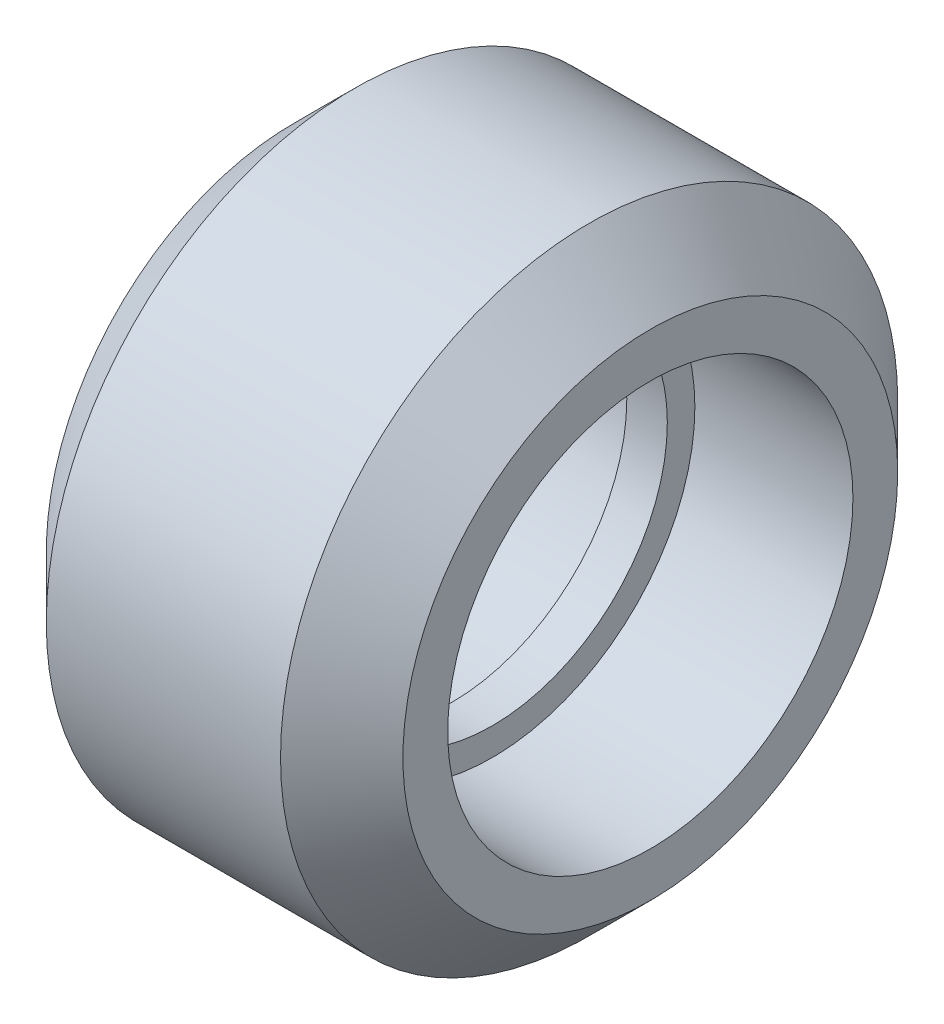
ISO-10303-21;
HEADER;
FILE_DESCRIPTION(('STEP AP214'),'2;1');
FILE_NAME('part.step','',(''),(''),'','','');
FILE_SCHEMA(('AUTOMOTIVE_DESIGN { 1 0 10303 214 1 1 1 1 }'));
ENDSEC;
DATA;
#1=APPLICATION_CONTEXT('core data for automotive mechanical design processes');
#2=APPLICATION_PROTOCOL_DEFINITION('international standard','automotive_design',2000,#1);
#3=PRODUCT_CONTEXT('',#1,'mechanical');
#4=PRODUCT('Part','Part','',(#3));
#5=PRODUCT_RELATED_PRODUCT_CATEGORY('part','',(#4));
#6=PRODUCT_DEFINITION_FORMATION('','',#4);
#7=PRODUCT_DEFINITION_CONTEXT('part definition',#1,'design');
#8=PRODUCT_DEFINITION('design','',#6,#7);
#9=PRODUCT_DEFINITION_SHAPE('','',#8);
#10=(LENGTH_UNIT() NAMED_UNIT(*) SI_UNIT(.MILLI.,.METRE.));
#11=(NAMED_UNIT(*) PLANE_ANGLE_UNIT() SI_UNIT($,.RADIAN.));
#12=(NAMED_UNIT(*) SI_UNIT($,.STERADIAN.) SOLID_ANGLE_UNIT());
#13=UNCERTAINTY_MEASURE_WITH_UNIT(LENGTH_MEASURE(1.E-05),#10,'distance_accuracy_value','');
#14=(GEOMETRIC_REPRESENTATION_CONTEXT(3) GLOBAL_UNCERTAINTY_ASSIGNED_CONTEXT((#13)) GLOBAL_UNIT_ASSIGNED_CONTEXT((#10,
#11,#12)) REPRESENTATION_CONTEXT('',''));
#15=CARTESIAN_POINT('',(0.,0.,0.));
#16=DIRECTION('',(0.,0.,1.));
#17=DIRECTION('',(1.,0.,0.));
#18=AXIS2_PLACEMENT_3D('',#15,#16,#17);
#19=CARTESIAN_POINT('',(-0.5,4.32,0.));
#20=DIRECTION('',(-1.,0.,0.));
#21=DIRECTION('',(0.,0.,1.));
#22=AXIS2_PLACEMENT_3D('',#19,#20,#21);
#23=PLANE('',#22);
#24=CARTESIAN_POINT('',(-0.5,0.,0.));
#25=DIRECTION('',(1.,0.,0.));
#26=DIRECTION('',(0.,0.,-1.));
#27=AXIS2_PLACEMENT_3D('',#24,#25,#26);
#28=CIRCLE('',#27,4.32);
#29=CARTESIAN_POINT('',(-0.5,0.,-4.32));
#30=VERTEX_POINT('',#29);
#31=EDGE_CURVE('E12',#30,#30,#28,.T.);
#32=ORIENTED_EDGE('',*,*,#31,.T.);
#33=EDGE_LOOP('',(#32));
#34=FACE_BOUND('',#33,.T.);
#35=CARTESIAN_POINT('',(-0.5,0.,0.));
#36=DIRECTION('',(1.,0.,0.));
#37=DIRECTION('',(0.,0.,-1.));
#38=AXIS2_PLACEMENT_3D('',#35,#36,#37);
#39=CIRCLE('',#38,5.);
#40=CARTESIAN_POINT('',(-0.5,0.,-5.));
#41=VERTEX_POINT('',#40);
#42=EDGE_CURVE('E76',#41,#41,#39,.T.);
#43=ORIENTED_EDGE('',*,*,#42,.F.);
#44=EDGE_LOOP('',(#43));
#45=FACE_BOUND('',#44,.T.);
#46=ADVANCED_FACE('F42',(#34,#45),#23,.T.);
#47=CARTESIAN_POINT('',(0.,0.,0.));
#48=DIRECTION('',(1.,0.,0.));
#49=DIRECTION('',(0.,0.,-1.));
#50=AXIS2_PLACEMENT_3D('',#47,#48,#49);
#51=CYLINDRICAL_SURFACE('',#50,4.32);
#52=CARTESIAN_POINT('',(0.5,0.,0.));
#53=DIRECTION('',(1.,0.,0.));
#54=DIRECTION('',(0.,0.,-1.));
#55=AXIS2_PLACEMENT_3D('',#52,#53,#54);
#56=CIRCLE('',#55,4.32);
#57=CARTESIAN_POINT('',(0.5,0.,-4.32));
#58=VERTEX_POINT('',#57);
#59=EDGE_CURVE('E48',#58,#58,#56,.T.);
#60=ORIENTED_EDGE('',*,*,#59,.T.);
#61=EDGE_LOOP('',(#60));
#62=FACE_BOUND('',#61,.T.);
#63=ORIENTED_EDGE('',*,*,#31,.F.);
#64=EDGE_LOOP('',(#63));
#65=FACE_BOUND('',#64,.T.);
#66=ADVANCED_FACE('F84',(#62,#65),#51,.F.);
#67=CARTESIAN_POINT('',(0.5,4.32,0.));
#68=DIRECTION('',(1.,0.,0.));
#69=DIRECTION('',(0.,0.,-1.));
#70=AXIS2_PLACEMENT_3D('',#67,#68,#69);
#71=PLANE('',#70);
#72=CARTESIAN_POINT('',(0.5,0.,0.));
#73=DIRECTION('',(1.,0.,0.));
#74=DIRECTION('',(0.,0.,-1.));
#75=AXIS2_PLACEMENT_3D('',#72,#73,#74);
#76=CIRCLE('',#75,5.);
#77=CARTESIAN_POINT('',(0.5,0.,-5.));
#78=VERTEX_POINT('',#77);
#79=EDGE_CURVE('E52',#78,#78,#76,.T.);
#80=ORIENTED_EDGE('',*,*,#79,.T.);
#81=EDGE_LOOP('',(#80));
#82=FACE_BOUND('',#81,.T.);
#83=ORIENTED_EDGE('',*,*,#59,.F.);
#84=EDGE_LOOP('',(#83));
#85=FACE_BOUND('',#84,.T.);
#86=ADVANCED_FACE('F88',(#82,#85),#71,.T.);
#87=CARTESIAN_POINT('',(0.,0.,0.));
#88=DIRECTION('',(1.,0.,0.));
#89=DIRECTION('',(0.,0.,-1.));
#90=AXIS2_PLACEMENT_3D('',#87,#88,#89);
#91=CYLINDRICAL_SURFACE('',#90,5.);
#92=CARTESIAN_POINT('',(4.4,0.,0.));
#93=DIRECTION('',(1.,0.,0.));
#94=DIRECTION('',(0.,0.,-1.));
#95=AXIS2_PLACEMENT_3D('',#92,#93,#94);
#96=CIRCLE('',#95,5.);
#97=CARTESIAN_POINT('',(4.4,0.,-5.));
#98=VERTEX_POINT('',#97);
#99=EDGE_CURVE('E56',#98,#98,#96,.T.);
#100=ORIENTED_EDGE('',*,*,#99,.T.);
#101=EDGE_LOOP('',(#100));
#102=FACE_BOUND('',#101,.T.);
#103=ORIENTED_EDGE('',*,*,#79,.F.);
#104=EDGE_LOOP('',(#103));
#105=FACE_BOUND('',#104,.T.);
#106=ADVANCED_FACE('F92',(#102,#105),#91,.F.);
#107=CARTESIAN_POINT('',(4.4,5.,0.));
#108=DIRECTION('',(1.,0.,0.));
#109=DIRECTION('',(0.,0.,-1.));
#110=AXIS2_PLACEMENT_3D('',#107,#108,#109);
#111=PLANE('',#110);
#112=CARTESIAN_POINT('',(4.4,0.,0.));
#113=DIRECTION('',(1.,0.,0.));
#114=DIRECTION('',(0.,0.,-1.));
#115=AXIS2_PLACEMENT_3D('',#112,#113,#114);
#116=CIRCLE('',#115,6.10500000000001);
#117=CARTESIAN_POINT('',(4.4,0.,-6.10500000000001));
#118=VERTEX_POINT('',#117);
#119=EDGE_CURVE('E61',#118,#118,#116,.T.);
#120=ORIENTED_EDGE('',*,*,#119,.T.);
#121=EDGE_LOOP('',(#120));
#122=FACE_BOUND('',#121,.T.);
#123=ORIENTED_EDGE('',*,*,#99,.F.);
#124=EDGE_LOOP('',(#123));
#125=FACE_BOUND('',#124,.T.);
#126=ADVANCED_FACE('F99',(#122,#125),#111,.T.);
#127=CARTESIAN_POINT('',(4.4,0.,0.));
#128=DIRECTION('',(-1.,0.,0.));
#129=DIRECTION('',(0.,0.,1.));
#130=AXIS2_PLACEMENT_3D('',#127,#128,#129);
#131=CONICAL_SURFACE('',#130,6.10500000000001,0.785398163397447);
#132=CARTESIAN_POINT('',(2.89,0.,0.));
#133=DIRECTION('',(1.,0.,0.));
#134=DIRECTION('',(0.,0.,-1.));
#135=AXIS2_PLACEMENT_3D('',#132,#133,#134);
#136=CIRCLE('',#135,7.615);
#137=CARTESIAN_POINT('',(2.89,0.,-7.615));
#138=VERTEX_POINT('',#137);
#139=EDGE_CURVE('E64',#138,#138,#136,.T.);
#140=ORIENTED_EDGE('',*,*,#139,.T.);
#141=EDGE_LOOP('',(#140));
#142=FACE_BOUND('',#141,.T.);
#143=ORIENTED_EDGE('',*,*,#119,.F.);
#144=EDGE_LOOP('',(#143));
#145=FACE_BOUND('',#144,.T.);
#146=ADVANCED_FACE('F103',(#142,#145),#131,.T.);
#147=CARTESIAN_POINT('',(0.,0.,0.));
#148=DIRECTION('',(1.,0.,0.));
#149=DIRECTION('',(0.,0.,-1.));
#150=AXIS2_PLACEMENT_3D('',#147,#148,#149);
#151=CYLINDRICAL_SURFACE('',#150,7.615);
#152=CARTESIAN_POINT('',(-2.89,0.,0.));
#153=DIRECTION('',(1.,0.,0.));
#154=DIRECTION('',(0.,0.,-1.));
#155=AXIS2_PLACEMENT_3D('',#152,#153,#154);
#156=CIRCLE('',#155,7.615);
#157=CARTESIAN_POINT('',(-2.89,0.,-7.615));
#158=VERTEX_POINT('',#157);
#159=EDGE_CURVE('E67',#158,#158,#156,.T.);
#160=ORIENTED_EDGE('',*,*,#159,.T.);
#161=EDGE_LOOP('',(#160));
#162=FACE_BOUND('',#161,.T.);
#163=ORIENTED_EDGE('',*,*,#139,.F.);
#164=EDGE_LOOP('',(#163));
#165=FACE_BOUND('',#164,.T.);
#166=ADVANCED_FACE('F107',(#162,#165),#151,.T.);
#167=CARTESIAN_POINT('',(-2.89,0.,0.));
#168=DIRECTION('',(1.,0.,0.));
#169=DIRECTION('',(0.,0.,-1.));
#170=AXIS2_PLACEMENT_3D('',#167,#168,#169);
#171=CONICAL_SURFACE('',#170,7.615,0.785398163397447);
#172=CARTESIAN_POINT('',(-4.4,0.,0.));
#173=DIRECTION('',(1.,0.,0.));
#174=DIRECTION('',(0.,0.,-1.));
#175=AXIS2_PLACEMENT_3D('',#172,#173,#174);
#176=CIRCLE('',#175,6.105);
#177=CARTESIAN_POINT('',(-4.4,0.,-6.105));
#178=VERTEX_POINT('',#177);
#179=EDGE_CURVE('E70',#178,#178,#176,.T.);
#180=ORIENTED_EDGE('',*,*,#179,.T.);
#181=EDGE_LOOP('',(#180));
#182=FACE_BOUND('',#181,.T.);
#183=ORIENTED_EDGE('',*,*,#159,.F.);
#184=EDGE_LOOP('',(#183));
#185=FACE_BOUND('',#184,.T.);
#186=ADVANCED_FACE('F111',(#182,#185),#171,.T.);
#187=CARTESIAN_POINT('',(-4.4,5.,0.));
#188=DIRECTION('',(-1.,0.,0.));
#189=DIRECTION('',(0.,0.,1.));
#190=AXIS2_PLACEMENT_3D('',#187,#188,#189);
#191=PLANE('',#190);
#192=CARTESIAN_POINT('',(-4.4,0.,0.));
#193=DIRECTION('',(1.,0.,0.));
#194=DIRECTION('',(0.,0.,-1.));
#195=AXIS2_PLACEMENT_3D('',#192,#193,#194);
#196=CIRCLE('',#195,5.);
#197=CARTESIAN_POINT('',(-4.4,0.,-5.));
#198=VERTEX_POINT('',#197);
#199=EDGE_CURVE('E73',#198,#198,#196,.T.);
#200=ORIENTED_EDGE('',*,*,#199,.T.);
#201=EDGE_LOOP('',(#200));
#202=FACE_BOUND('',#201,.T.);
#203=ORIENTED_EDGE('',*,*,#179,.F.);
#204=EDGE_LOOP('',(#203));
#205=FACE_BOUND('',#204,.T.);
#206=ADVANCED_FACE('F115',(#202,#205),#191,.T.);
#207=CARTESIAN_POINT('',(0.,0.,0.));
#208=DIRECTION('',(1.,0.,0.));
#209=DIRECTION('',(0.,0.,-1.));
#210=AXIS2_PLACEMENT_3D('',#207,#208,#209);
#211=CYLINDRICAL_SURFACE('',#210,5.);
#212=ORIENTED_EDGE('',*,*,#42,.T.);
#213=EDGE_LOOP('',(#212));
#214=FACE_BOUND('',#213,.T.);
#215=ORIENTED_EDGE('',*,*,#199,.F.);
#216=EDGE_LOOP('',(#215));
#217=FACE_BOUND('',#216,.T.);
#218=ADVANCED_FACE('F80',(#214,#217),#211,.F.);
#219=CLOSED_SHELL('',(#46,#66,#86,#106,#126,#146,#166,#186,#206,#218));
#220=MANIFOLD_SOLID_BREP('B2',#219);
#221=ADVANCED_BREP_SHAPE_REPRESENTATION('',(#18,#220),#14);
#222=SHAPE_DEFINITION_REPRESENTATION(#9,#221);
ENDSEC;
END-ISO-10303-21;
